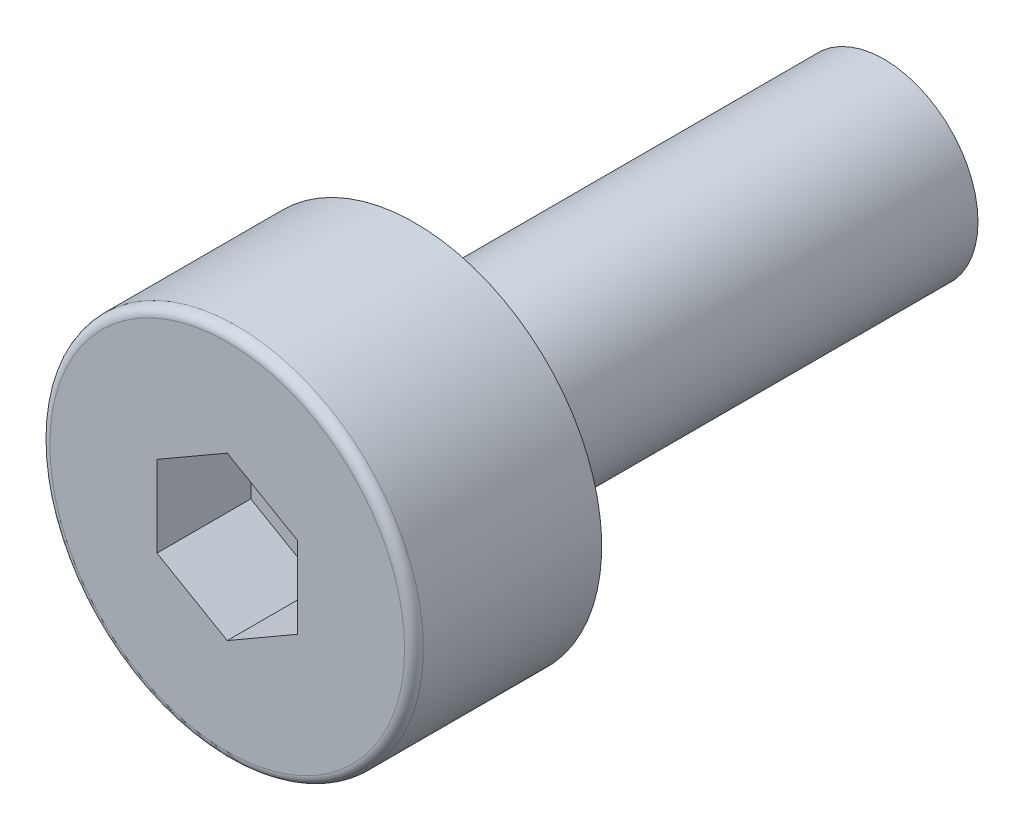
ISO-10303-21;
HEADER;
FILE_DESCRIPTION(('STEP AP214'),'2;1');
FILE_NAME('part.step','',(''),(''),'','','');
FILE_SCHEMA(('AUTOMOTIVE_DESIGN { 1 0 10303 214 1 1 1 1 }'));
ENDSEC;
DATA;
#1=APPLICATION_CONTEXT('core data for automotive mechanical design processes');
#2=APPLICATION_PROTOCOL_DEFINITION('international standard','automotive_design',2000,#1);
#3=PRODUCT_CONTEXT('',#1,'mechanical');
#4=PRODUCT('Part','Part','',(#3));
#5=PRODUCT_RELATED_PRODUCT_CATEGORY('part','',(#4));
#6=PRODUCT_DEFINITION_FORMATION('','',#4);
#7=PRODUCT_DEFINITION_CONTEXT('part definition',#1,'design');
#8=PRODUCT_DEFINITION('design','',#6,#7);
#9=PRODUCT_DEFINITION_SHAPE('','',#8);
#10=(LENGTH_UNIT() NAMED_UNIT(*) SI_UNIT(.MILLI.,.METRE.));
#11=(NAMED_UNIT(*) PLANE_ANGLE_UNIT() SI_UNIT($,.RADIAN.));
#12=(NAMED_UNIT(*) SI_UNIT($,.STERADIAN.) SOLID_ANGLE_UNIT());
#13=UNCERTAINTY_MEASURE_WITH_UNIT(LENGTH_MEASURE(1.E-05),#10,'distance_accuracy_value','');
#14=(GEOMETRIC_REPRESENTATION_CONTEXT(3) GLOBAL_UNCERTAINTY_ASSIGNED_CONTEXT((#13)) GLOBAL_UNIT_ASSIGNED_CONTEXT((#10,
#11,#12)) REPRESENTATION_CONTEXT('',''));
#15=CARTESIAN_POINT('',(0.,0.,0.));
#16=DIRECTION('',(0.,0.,1.));
#17=DIRECTION('',(1.,0.,0.));
#18=AXIS2_PLACEMENT_3D('',#15,#16,#17);
#19=CARTESIAN_POINT('',(0.,0.,1.));
#20=DIRECTION('',(0.,0.,1.));
#21=DIRECTION('',(1.,0.,0.));
#22=AXIS2_PLACEMENT_3D('',#19,#20,#21);
#23=PLANE('',#22);
#24=DIRECTION('',(-0.866025403784439,-0.5,0.));
#25=VECTOR('',#24,1.);
#26=CARTESIAN_POINT('',(0.,0.865000000000001,1.));
#27=LINE('',#26,#25);
#28=CARTESIAN_POINT('',(0.,0.865000000000001,1.));
#29=VERTEX_POINT('',#28);
#30=CARTESIAN_POINT('',(-0.749111974273539,0.4325,1.));
#31=VERTEX_POINT('',#30);
#32=EDGE_CURVE('E61',#29,#31,#27,.T.);
#33=ORIENTED_EDGE('',*,*,#32,.T.);
#34=DIRECTION('',(0.,1.,0.));
#35=VECTOR('',#34,1.);
#36=CARTESIAN_POINT('',(-0.749111974273539,0.4325,1.));
#37=LINE('',#36,#35);
#38=CARTESIAN_POINT('',(-0.749111974273539,-0.4325,1.));
#39=VERTEX_POINT('',#38);
#40=EDGE_CURVE('E63',#31,#39,#37,.F.);
#41=ORIENTED_EDGE('',*,*,#40,.T.);
#42=DIRECTION('',(0.866025403784439,-0.5,0.));
#43=VECTOR('',#42,1.);
#44=CARTESIAN_POINT('',(-0.749111974273539,-0.4325,1.));
#45=LINE('',#44,#43);
#46=CARTESIAN_POINT('',(0.,-0.865,1.));
#47=VERTEX_POINT('',#46);
#48=EDGE_CURVE('E65',#39,#47,#45,.T.);
#49=ORIENTED_EDGE('',*,*,#48,.T.);
#50=DIRECTION('',(0.866025403784438,0.5,0.));
#51=VECTOR('',#50,1.);
#52=CARTESIAN_POINT('',(0.,-0.865,1.));
#53=LINE('',#52,#51);
#54=CARTESIAN_POINT('',(0.749111974273539,-0.4325,1.));
#55=VERTEX_POINT('',#54);
#56=EDGE_CURVE('E134',#47,#55,#53,.T.);
#57=ORIENTED_EDGE('',*,*,#56,.T.);
#58=DIRECTION('',(0.,1.,0.));
#59=VECTOR('',#58,1.);
#60=CARTESIAN_POINT('',(0.749111974273539,-0.4325,1.));
#61=LINE('',#60,#59);
#62=CARTESIAN_POINT('',(0.749111974273539,0.432500000000001,1.));
#63=VERTEX_POINT('',#62);
#64=EDGE_CURVE('E140',#55,#63,#61,.T.);
#65=ORIENTED_EDGE('',*,*,#64,.T.);
#66=DIRECTION('',(-0.866025403784439,0.5,0.));
#67=VECTOR('',#66,1.);
#68=CARTESIAN_POINT('',(0.749111974273539,0.432500000000001,1.));
#69=LINE('',#68,#67);
#70=EDGE_CURVE('E145',#63,#29,#69,.T.);
#71=ORIENTED_EDGE('',*,*,#70,.T.);
#72=EDGE_LOOP('',(#33,#41,#49,#57,#65,#71));
#73=FACE_BOUND('',#72,.T.);
#74=ADVANCED_FACE('F17',(#73),#23,.T.);
#75=CARTESIAN_POINT('',(-0.749111974273539,-0.4325,1.));
#76=DIRECTION('',(-0.5,-0.866025403784439,0.));
#77=DIRECTION('',(0.866025403784439,-0.5,0.));
#78=AXIS2_PLACEMENT_3D('',#75,#76,#77);
#79=PLANE('',#78);
#80=DIRECTION('',(0.,0.,1.));
#81=VECTOR('',#80,1.);
#82=CARTESIAN_POINT('',(0.,-0.865,1.));
#83=LINE('',#82,#81);
#84=CARTESIAN_POINT('',(0.,-0.865,2.));
#85=VERTEX_POINT('',#84);
#86=EDGE_CURVE('E79',#85,#47,#83,.F.);
#87=ORIENTED_EDGE('',*,*,#86,.T.);
#88=ORIENTED_EDGE('',*,*,#48,.F.);
#89=DIRECTION('',(0.,0.,1.));
#90=VECTOR('',#89,1.);
#91=CARTESIAN_POINT('',(-0.749111974273539,-0.4325,1.));
#92=LINE('',#91,#90);
#93=CARTESIAN_POINT('',(-0.749111974273539,-0.4325,2.));
#94=VERTEX_POINT('',#93);
#95=EDGE_CURVE('E71',#39,#94,#92,.T.);
#96=ORIENTED_EDGE('',*,*,#95,.T.);
#97=DIRECTION('',(-0.866025403784439,0.5,0.));
#98=VECTOR('',#97,1.);
#99=CARTESIAN_POINT('',(0.,-0.865,2.));
#100=LINE('',#99,#98);
#101=EDGE_CURVE('E133',#85,#94,#100,.T.);
#102=ORIENTED_EDGE('',*,*,#101,.F.);
#103=EDGE_LOOP('',(#87,#88,#96,#102));
#104=FACE_BOUND('',#103,.T.);
#105=ADVANCED_FACE('F75',(#104),#79,.F.);
#106=CARTESIAN_POINT('',(-0.749111974273539,0.4325,1.));
#107=DIRECTION('',(-1.,0.,0.));
#108=DIRECTION('',(0.,0.,1.));
#109=AXIS2_PLACEMENT_3D('',#106,#107,#108);
#110=PLANE('',#109);
#111=ORIENTED_EDGE('',*,*,#95,.F.);
#112=ORIENTED_EDGE('',*,*,#40,.F.);
#113=DIRECTION('',(0.,0.,1.));
#114=VECTOR('',#113,1.);
#115=CARTESIAN_POINT('',(-0.749111974273539,0.4325,1.));
#116=LINE('',#115,#114);
#117=CARTESIAN_POINT('',(-0.749111974273539,0.4325,2.));
#118=VERTEX_POINT('',#117);
#119=EDGE_CURVE('E87',#31,#118,#116,.T.);
#120=ORIENTED_EDGE('',*,*,#119,.T.);
#121=DIRECTION('',(0.,1.,0.));
#122=VECTOR('',#121,1.);
#123=CARTESIAN_POINT('',(-0.749111974273539,0.,2.));
#124=LINE('',#123,#122);
#125=EDGE_CURVE('E84',#94,#118,#124,.T.);
#126=ORIENTED_EDGE('',*,*,#125,.F.);
#127=EDGE_LOOP('',(#111,#112,#120,#126));
#128=FACE_BOUND('',#127,.T.);
#129=ADVANCED_FACE('F82',(#128),#110,.F.);
#130=CARTESIAN_POINT('',(0.,0.865000000000001,1.));
#131=DIRECTION('',(-0.5,0.866025403784439,0.));
#132=DIRECTION('',(-0.866025403784439,-0.5,0.));
#133=AXIS2_PLACEMENT_3D('',#130,#131,#132);
#134=PLANE('',#133);
#135=ORIENTED_EDGE('',*,*,#119,.F.);
#136=ORIENTED_EDGE('',*,*,#32,.F.);
#137=DIRECTION('',(0.,0.,1.));
#138=VECTOR('',#137,1.);
#139=CARTESIAN_POINT('',(0.,0.865000000000001,1.));
#140=LINE('',#139,#138);
#141=CARTESIAN_POINT('',(0.,0.865000000000001,2.));
#142=VERTEX_POINT('',#141);
#143=EDGE_CURVE('E142',#29,#142,#140,.T.);
#144=ORIENTED_EDGE('',*,*,#143,.T.);
#145=DIRECTION('',(0.866025403784439,0.5,0.));
#146=VECTOR('',#145,1.);
#147=CARTESIAN_POINT('',(-0.749111974273539,0.4325,2.));
#148=LINE('',#147,#146);
#149=EDGE_CURVE('E152',#118,#142,#148,.T.);
#150=ORIENTED_EDGE('',*,*,#149,.F.);
#151=EDGE_LOOP('',(#135,#136,#144,#150));
#152=FACE_BOUND('',#151,.T.);
#153=ADVANCED_FACE('F153',(#152),#134,.F.);
#154=CARTESIAN_POINT('',(0.749111974273539,0.432500000000001,1.));
#155=DIRECTION('',(0.5,0.866025403784439,0.));
#156=DIRECTION('',(-0.866025403784439,0.5,0.));
#157=AXIS2_PLACEMENT_3D('',#154,#155,#156);
#158=PLANE('',#157);
#159=ORIENTED_EDGE('',*,*,#143,.F.);
#160=ORIENTED_EDGE('',*,*,#70,.F.);
#161=DIRECTION('',(0.,0.,-1.));
#162=VECTOR('',#161,1.);
#163=CARTESIAN_POINT('',(0.749111974273539,0.432500000000001,1.));
#164=LINE('',#163,#162);
#165=CARTESIAN_POINT('',(0.749111974273539,0.432500000000001,2.));
#166=VERTEX_POINT('',#165);
#167=EDGE_CURVE('E137',#63,#166,#164,.F.);
#168=ORIENTED_EDGE('',*,*,#167,.T.);
#169=DIRECTION('',(0.866025403784439,-0.5,0.));
#170=VECTOR('',#169,1.);
#171=CARTESIAN_POINT('',(0.,0.865000000000001,2.));
#172=LINE('',#171,#170);
#173=EDGE_CURVE('E158',#142,#166,#172,.T.);
#174=ORIENTED_EDGE('',*,*,#173,.F.);
#175=EDGE_LOOP('',(#159,#160,#168,#174));
#176=FACE_BOUND('',#175,.T.);
#177=ADVANCED_FACE('F241',(#176),#158,.F.);
#178=CARTESIAN_POINT('',(0.749111974273539,-0.4325,1.));
#179=DIRECTION('',(1.,0.,0.));
#180=DIRECTION('',(0.,0.,-1.));
#181=AXIS2_PLACEMENT_3D('',#178,#179,#180);
#182=PLANE('',#181);
#183=ORIENTED_EDGE('',*,*,#167,.F.);
#184=ORIENTED_EDGE('',*,*,#64,.F.);
#185=DIRECTION('',(0.,0.,1.));
#186=VECTOR('',#185,1.);
#187=CARTESIAN_POINT('',(0.749111974273539,-0.432499999999999,1.));
#188=LINE('',#187,#186);
#189=CARTESIAN_POINT('',(0.749111974273539,-0.4325,2.));
#190=VERTEX_POINT('',#189);
#191=EDGE_CURVE('E125',#55,#190,#188,.T.);
#192=ORIENTED_EDGE('',*,*,#191,.T.);
#193=DIRECTION('',(0.,1.,0.));
#194=VECTOR('',#193,1.);
#195=CARTESIAN_POINT('',(0.749111974273539,0.,2.));
#196=LINE('',#195,#194);
#197=EDGE_CURVE('E166',#166,#190,#196,.F.);
#198=ORIENTED_EDGE('',*,*,#197,.F.);
#199=EDGE_LOOP('',(#183,#184,#192,#198));
#200=FACE_BOUND('',#199,.T.);
#201=ADVANCED_FACE('F191',(#200),#182,.F.);
#202=CARTESIAN_POINT('',(0.,-0.865,1.));
#203=DIRECTION('',(0.5,-0.866025403784438,0.));
#204=DIRECTION('',(0.866025403784438,0.5,0.));
#205=AXIS2_PLACEMENT_3D('',#202,#203,#204);
#206=PLANE('',#205);
#207=ORIENTED_EDGE('',*,*,#191,.F.);
#208=ORIENTED_EDGE('',*,*,#56,.F.);
#209=ORIENTED_EDGE('',*,*,#86,.F.);
#210=DIRECTION('',(-0.866025403784438,-0.5,0.));
#211=VECTOR('',#210,1.);
#212=CARTESIAN_POINT('',(0.749111974273539,-0.4325,2.));
#213=LINE('',#212,#211);
#214=EDGE_CURVE('E168',#190,#85,#213,.T.);
#215=ORIENTED_EDGE('',*,*,#214,.F.);
#216=EDGE_LOOP('',(#207,#208,#209,#215));
#217=FACE_BOUND('',#216,.T.);
#218=ADVANCED_FACE('F186',(#217),#206,.F.);
#219=CARTESIAN_POINT('',(0.,0.,2.));
#220=DIRECTION('',(0.,0.,1.));
#221=DIRECTION('',(1.,0.,0.));
#222=AXIS2_PLACEMENT_3D('',#219,#220,#221);
#223=PLANE('',#222);
#224=ORIENTED_EDGE('',*,*,#197,.T.);
#225=ORIENTED_EDGE('',*,*,#214,.T.);
#226=ORIENTED_EDGE('',*,*,#101,.T.);
#227=ORIENTED_EDGE('',*,*,#125,.T.);
#228=ORIENTED_EDGE('',*,*,#149,.T.);
#229=ORIENTED_EDGE('',*,*,#173,.T.);
#230=EDGE_LOOP('',(#224,#225,#226,#227,#228,#229));
#231=FACE_BOUND('',#230,.T.);
#232=CARTESIAN_POINT('',(0.,0.,2.));
#233=DIRECTION('',(0.,0.,-1.));
#234=DIRECTION('',(-1.,0.,0.));
#235=AXIS2_PLACEMENT_3D('',#232,#233,#234);
#236=CIRCLE('',#235,1.89);
#237=CARTESIAN_POINT('',(-1.89,0.,2.));
#238=VERTEX_POINT('',#237);
#239=CARTESIAN_POINT('',(1.89,0.,2.));
#240=VERTEX_POINT('',#239);
#241=EDGE_CURVE('E36',#238,#240,#236,.T.);
#242=ORIENTED_EDGE('',*,*,#241,.F.);
#243=CARTESIAN_POINT('',(0.,0.,2.));
#244=DIRECTION('',(0.,0.,-1.));
#245=DIRECTION('',(1.,0.,0.));
#246=AXIS2_PLACEMENT_3D('',#243,#244,#245);
#247=CIRCLE('',#246,1.89);
#248=EDGE_CURVE('E99',#240,#238,#247,.T.);
#249=ORIENTED_EDGE('',*,*,#248,.F.);
#250=EDGE_LOOP('',(#242,#249));
#251=FACE_BOUND('',#250,.T.);
#252=ADVANCED_FACE('F113',(#231,#251),#223,.T.);
#253=CARTESIAN_POINT('',(0.,0.,1.9));
#254=DIRECTION('',(0.,0.,1.));
#255=DIRECTION('',(1.,0.,0.));
#256=AXIS2_PLACEMENT_3D('',#253,#254,#255);
#257=TOROIDAL_SURFACE('',#256,1.89,0.1);
#258=CARTESIAN_POINT('',(0.,0.,1.9));
#259=DIRECTION('',(0.,0.,-1.));
#260=DIRECTION('',(-1.,0.,0.));
#261=AXIS2_PLACEMENT_3D('',#258,#259,#260);
#262=CIRCLE('',#261,1.99);
#263=CARTESIAN_POINT('',(-1.99,0.,1.9));
#264=VERTEX_POINT('',#263);
#265=EDGE_CURVE('E95',#264,#264,#262,.T.);
#266=ORIENTED_EDGE('',*,*,#265,.F.);
#267=EDGE_LOOP('',(#266));
#268=FACE_BOUND('',#267,.T.);
#269=ORIENTED_EDGE('',*,*,#248,.T.);
#270=ORIENTED_EDGE('',*,*,#241,.T.);
#271=EDGE_LOOP('',(#269,#270));
#272=FACE_BOUND('',#271,.T.);
#273=ADVANCED_FACE('F107',(#268,#272),#257,.T.);
#274=CARTESIAN_POINT('',(0.,0.,2.));
#275=DIRECTION('',(0.,0.,-1.));
#276=DIRECTION('',(-1.,0.,0.));
#277=AXIS2_PLACEMENT_3D('',#274,#275,#276);
#278=CYLINDRICAL_SURFACE('',#277,1.99);
#279=ORIENTED_EDGE('',*,*,#265,.T.);
#280=EDGE_LOOP('',(#279));
#281=FACE_BOUND('',#280,.T.);
#282=CARTESIAN_POINT('',(0.,0.,0.));
#283=DIRECTION('',(0.,0.,-1.));
#284=DIRECTION('',(-1.,0.,0.));
#285=AXIS2_PLACEMENT_3D('',#282,#283,#284);
#286=CIRCLE('',#285,1.99);
#287=CARTESIAN_POINT('',(-1.99,0.,0.));
#288=VERTEX_POINT('',#287);
#289=EDGE_CURVE('E93',#288,#288,#286,.F.);
#290=ORIENTED_EDGE('',*,*,#289,.T.);
#291=EDGE_LOOP('',(#290));
#292=FACE_BOUND('',#291,.T.);
#293=ADVANCED_FACE('F112',(#281,#292),#278,.T.);
#294=CARTESIAN_POINT('',(0.,0.,-5.));
#295=DIRECTION('',(0.,0.,-1.));
#296=DIRECTION('',(-1.,0.,0.));
#297=AXIS2_PLACEMENT_3D('',#294,#295,#296);
#298=PLANE('',#297);
#299=CARTESIAN_POINT('',(0.,0.,-5.));
#300=DIRECTION('',(0.,0.,1.));
#301=DIRECTION('',(1.,0.,0.));
#302=AXIS2_PLACEMENT_3D('',#299,#300,#301);
#303=CIRCLE('',#302,1.);
#304=CARTESIAN_POINT('',(1.,0.,-5.));
#305=VERTEX_POINT('',#304);
#306=EDGE_CURVE('E28',#305,#305,#303,.T.);
#307=ORIENTED_EDGE('',*,*,#306,.F.);
#308=EDGE_LOOP('',(#307));
#309=FACE_BOUND('',#308,.T.);
#310=ADVANCED_FACE('F201',(#309),#298,.T.);
#311=CARTESIAN_POINT('',(0.,0.,0.));
#312=DIRECTION('',(0.,0.,1.));
#313=DIRECTION('',(1.,0.,0.));
#314=AXIS2_PLACEMENT_3D('',#311,#312,#313);
#315=PLANE('',#314);
#316=CARTESIAN_POINT('',(0.,0.,0.));
#317=DIRECTION('',(0.,0.,1.));
#318=DIRECTION('',(1.,0.,0.));
#319=AXIS2_PLACEMENT_3D('',#316,#317,#318);
#320=CIRCLE('',#319,1.);
#321=CARTESIAN_POINT('',(1.,0.,0.));
#322=VERTEX_POINT('',#321);
#323=EDGE_CURVE('E11',#322,#322,#320,.F.);
#324=ORIENTED_EDGE('',*,*,#323,.F.);
#325=EDGE_LOOP('',(#324));
#326=FACE_BOUND('',#325,.T.);
#327=ORIENTED_EDGE('',*,*,#289,.F.);
#328=EDGE_LOOP('',(#327));
#329=FACE_BOUND('',#328,.T.);
#330=ADVANCED_FACE('F195',(#326,#329),#315,.F.);
#331=CARTESIAN_POINT('',(0.,0.,-5.));
#332=DIRECTION('',(0.,0.,1.));
#333=DIRECTION('',(1.,0.,0.));
#334=AXIS2_PLACEMENT_3D('',#331,#332,#333);
#335=CYLINDRICAL_SURFACE('',#334,1.);
#336=ORIENTED_EDGE('',*,*,#323,.T.);
#337=EDGE_LOOP('',(#336));
#338=FACE_BOUND('',#337,.T.);
#339=ORIENTED_EDGE('',*,*,#306,.T.);
#340=EDGE_LOOP('',(#339));
#341=FACE_BOUND('',#340,.T.);
#342=ADVANCED_FACE('F193',(#338,#341),#335,.T.);
#343=CLOSED_SHELL('',(#74,#105,#129,#153,#177,#201,#218,#252,#273,#293,#310,#330,#342));
#344=MANIFOLD_SOLID_BREP('B1',#343);
#345=ADVANCED_BREP_SHAPE_REPRESENTATION('',(#18,#344),#14);
#346=SHAPE_DEFINITION_REPRESENTATION(#9,#345);
ENDSEC;
END-ISO-10303-21;
